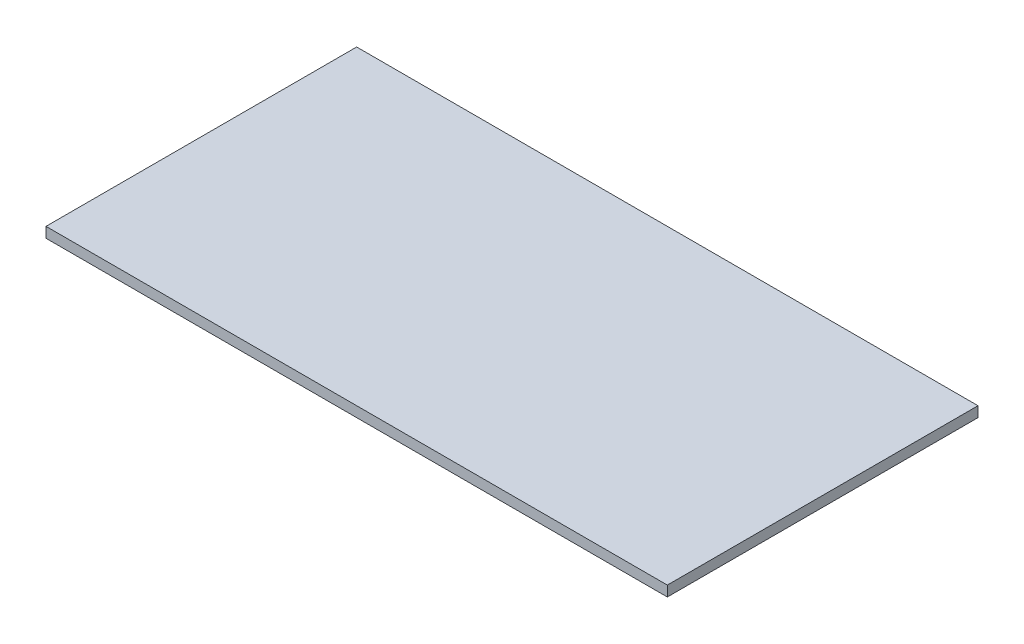
ISO-10303-21;
HEADER;
FILE_DESCRIPTION(('STEP AP214'),'2;1');
FILE_NAME('part.step','',(''),(''),'','','');
FILE_SCHEMA(('AUTOMOTIVE_DESIGN { 1 0 10303 214 1 1 1 1 }'));
ENDSEC;
DATA;
#1=APPLICATION_CONTEXT('core data for automotive mechanical design processes');
#2=APPLICATION_PROTOCOL_DEFINITION('international standard','automotive_design',2000,#1);
#3=PRODUCT_CONTEXT('',#1,'mechanical');
#4=PRODUCT('Part','Part','',(#3));
#5=PRODUCT_RELATED_PRODUCT_CATEGORY('part','',(#4));
#6=PRODUCT_DEFINITION_FORMATION('','',#4);
#7=PRODUCT_DEFINITION_CONTEXT('part definition',#1,'design');
#8=PRODUCT_DEFINITION('design','',#6,#7);
#9=PRODUCT_DEFINITION_SHAPE('','',#8);
#10=(LENGTH_UNIT() NAMED_UNIT(*) SI_UNIT(.MILLI.,.METRE.));
#11=(NAMED_UNIT(*) PLANE_ANGLE_UNIT() SI_UNIT($,.RADIAN.));
#12=(NAMED_UNIT(*) SI_UNIT($,.STERADIAN.) SOLID_ANGLE_UNIT());
#13=UNCERTAINTY_MEASURE_WITH_UNIT(LENGTH_MEASURE(1.E-05),#10,'distance_accuracy_value','');
#14=(GEOMETRIC_REPRESENTATION_CONTEXT(3) GLOBAL_UNCERTAINTY_ASSIGNED_CONTEXT((#13)) GLOBAL_UNIT_ASSIGNED_CONTEXT((#10,
#11,#12)) REPRESENTATION_CONTEXT('',''));
#15=CARTESIAN_POINT('',(0.,0.,0.));
#16=DIRECTION('',(0.,0.,1.));
#17=DIRECTION('',(1.,0.,0.));
#18=AXIS2_PLACEMENT_3D('',#15,#16,#17);
#19=CARTESIAN_POINT('',(-300.,10.,150.));
#20=DIRECTION('',(1.,0.,0.));
#21=DIRECTION('',(0.,0.,-1.));
#22=AXIS2_PLACEMENT_3D('',#19,#20,#21);
#23=PLANE('',#22);
#24=DIRECTION('',(0.,0.,1.));
#25=VECTOR('',#24,1.);
#26=CARTESIAN_POINT('',(-300.,0.,150.));
#27=LINE('',#26,#25);
#28=CARTESIAN_POINT('',(-300.,0.,-150.));
#29=VERTEX_POINT('',#28);
#30=CARTESIAN_POINT('',(-300.,0.,150.));
#31=VERTEX_POINT('',#30);
#32=EDGE_CURVE('E99',#29,#31,#27,.T.);
#33=ORIENTED_EDGE('',*,*,#32,.T.);
#34=DIRECTION('',(0.,-1.,0.));
#35=VECTOR('',#34,1.);
#36=CARTESIAN_POINT('',(-300.,10.,150.));
#37=LINE('',#36,#35);
#38=CARTESIAN_POINT('',(-300.,10.,150.));
#39=VERTEX_POINT('',#38);
#40=EDGE_CURVE('E11',#39,#31,#37,.T.);
#41=ORIENTED_EDGE('',*,*,#40,.F.);
#42=DIRECTION('',(0.,0.,1.));
#43=VECTOR('',#42,1.);
#44=CARTESIAN_POINT('',(-300.,10.,150.));
#45=LINE('',#44,#43);
#46=CARTESIAN_POINT('',(-300.,10.,-150.));
#47=VERTEX_POINT('',#46);
#48=EDGE_CURVE('E87',#47,#39,#45,.T.);
#49=ORIENTED_EDGE('',*,*,#48,.F.);
#50=DIRECTION('',(0.,-1.,0.));
#51=VECTOR('',#50,1.);
#52=CARTESIAN_POINT('',(-300.,10.,-150.));
#53=LINE('',#52,#51);
#54=EDGE_CURVE('E95',#47,#29,#53,.T.);
#55=ORIENTED_EDGE('',*,*,#54,.T.);
#56=EDGE_LOOP('',(#33,#41,#49,#55));
#57=FACE_BOUND('',#56,.T.);
#58=ADVANCED_FACE('F36',(#57),#23,.F.);
#59=CARTESIAN_POINT('',(300.,10.,150.));
#60=DIRECTION('',(0.,0.,-1.));
#61=DIRECTION('',(-1.,0.,0.));
#62=AXIS2_PLACEMENT_3D('',#59,#60,#61);
#63=PLANE('',#62);
#64=DIRECTION('',(1.,0.,0.));
#65=VECTOR('',#64,1.);
#66=CARTESIAN_POINT('',(300.,0.,150.));
#67=LINE('',#66,#65);
#68=CARTESIAN_POINT('',(300.,0.,150.));
#69=VERTEX_POINT('',#68);
#70=EDGE_CURVE('E91',#31,#69,#67,.T.);
#71=ORIENTED_EDGE('',*,*,#70,.T.);
#72=DIRECTION('',(0.,-1.,0.));
#73=VECTOR('',#72,1.);
#74=CARTESIAN_POINT('',(300.,10.,150.));
#75=LINE('',#74,#73);
#76=CARTESIAN_POINT('',(300.,10.,150.));
#77=VERTEX_POINT('',#76);
#78=EDGE_CURVE('E44',#77,#69,#75,.T.);
#79=ORIENTED_EDGE('',*,*,#78,.F.);
#80=DIRECTION('',(1.,0.,0.));
#81=VECTOR('',#80,1.);
#82=CARTESIAN_POINT('',(300.,10.,150.));
#83=LINE('',#82,#81);
#84=EDGE_CURVE('E82',#39,#77,#83,.T.);
#85=ORIENTED_EDGE('',*,*,#84,.F.);
#86=ORIENTED_EDGE('',*,*,#40,.T.);
#87=EDGE_LOOP('',(#71,#79,#85,#86));
#88=FACE_BOUND('',#87,.T.);
#89=ADVANCED_FACE('F90',(#88),#63,.F.);
#90=CARTESIAN_POINT('',(300.,10.,150.));
#91=DIRECTION('',(-1.,0.,0.));
#92=DIRECTION('',(0.,0.,1.));
#93=AXIS2_PLACEMENT_3D('',#90,#91,#92);
#94=PLANE('',#93);
#95=DIRECTION('',(0.,0.,-1.));
#96=VECTOR('',#95,1.);
#97=CARTESIAN_POINT('',(300.,0.,150.));
#98=LINE('',#97,#96);
#99=CARTESIAN_POINT('',(300.,0.,-150.));
#100=VERTEX_POINT('',#99);
#101=EDGE_CURVE('E69',#69,#100,#98,.T.);
#102=ORIENTED_EDGE('',*,*,#101,.T.);
#103=DIRECTION('',(0.,-1.,0.));
#104=VECTOR('',#103,1.);
#105=CARTESIAN_POINT('',(300.,10.,-150.));
#106=LINE('',#105,#104);
#107=CARTESIAN_POINT('',(300.,10.,-150.));
#108=VERTEX_POINT('',#107);
#109=EDGE_CURVE('E92',#108,#100,#106,.T.);
#110=ORIENTED_EDGE('',*,*,#109,.F.);
#111=DIRECTION('',(0.,0.,-1.));
#112=VECTOR('',#111,1.);
#113=CARTESIAN_POINT('',(300.,10.,150.));
#114=LINE('',#113,#112);
#115=EDGE_CURVE('E85',#77,#108,#114,.T.);
#116=ORIENTED_EDGE('',*,*,#115,.F.);
#117=ORIENTED_EDGE('',*,*,#78,.T.);
#118=EDGE_LOOP('',(#102,#110,#116,#117));
#119=FACE_BOUND('',#118,.T.);
#120=ADVANCED_FACE('F93',(#119),#94,.F.);
#121=CARTESIAN_POINT('',(300.,10.,-150.));
#122=DIRECTION('',(0.,0.,1.));
#123=DIRECTION('',(1.,0.,0.));
#124=AXIS2_PLACEMENT_3D('',#121,#122,#123);
#125=PLANE('',#124);
#126=DIRECTION('',(-1.,0.,0.));
#127=VECTOR('',#126,1.);
#128=CARTESIAN_POINT('',(300.,0.,-150.));
#129=LINE('',#128,#127);
#130=EDGE_CURVE('E75',#100,#29,#129,.T.);
#131=ORIENTED_EDGE('',*,*,#130,.T.);
#132=ORIENTED_EDGE('',*,*,#54,.F.);
#133=DIRECTION('',(-1.,0.,0.));
#134=VECTOR('',#133,1.);
#135=CARTESIAN_POINT('',(300.,10.,-150.));
#136=LINE('',#135,#134);
#137=EDGE_CURVE('E52',#108,#47,#136,.T.);
#138=ORIENTED_EDGE('',*,*,#137,.F.);
#139=ORIENTED_EDGE('',*,*,#109,.T.);
#140=EDGE_LOOP('',(#131,#132,#138,#139));
#141=FACE_BOUND('',#140,.T.);
#142=ADVANCED_FACE('F106',(#141),#125,.F.);
#143=CARTESIAN_POINT('',(0.,10.,0.));
#144=DIRECTION('',(0.,1.,0.));
#145=DIRECTION('',(0.,0.,1.));
#146=AXIS2_PLACEMENT_3D('',#143,#144,#145);
#147=PLANE('',#146);
#148=ORIENTED_EDGE('',*,*,#48,.T.);
#149=ORIENTED_EDGE('',*,*,#84,.T.);
#150=ORIENTED_EDGE('',*,*,#115,.T.);
#151=ORIENTED_EDGE('',*,*,#137,.T.);
#152=EDGE_LOOP('',(#148,#149,#150,#151));
#153=FACE_BOUND('',#152,.T.);
#154=ADVANCED_FACE('F83',(#153),#147,.T.);
#155=CARTESIAN_POINT('',(0.,0.,0.));
#156=DIRECTION('',(0.,1.,0.));
#157=DIRECTION('',(0.,0.,1.));
#158=AXIS2_PLACEMENT_3D('',#155,#156,#157);
#159=PLANE('',#158);
#160=ORIENTED_EDGE('',*,*,#32,.F.);
#161=ORIENTED_EDGE('',*,*,#130,.F.);
#162=ORIENTED_EDGE('',*,*,#101,.F.);
#163=ORIENTED_EDGE('',*,*,#70,.F.);
#164=EDGE_LOOP('',(#160,#161,#162,#163));
#165=FACE_BOUND('',#164,.T.);
#166=ADVANCED_FACE('F109',(#165),#159,.F.);
#167=CLOSED_SHELL('',(#58,#89,#120,#142,#154,#166));
#168=MANIFOLD_SOLID_BREP('B2',#167);
#169=ADVANCED_BREP_SHAPE_REPRESENTATION('',(#18,#168),#14);
#170=SHAPE_DEFINITION_REPRESENTATION(#9,#169);
ENDSEC;
END-ISO-10303-21;
